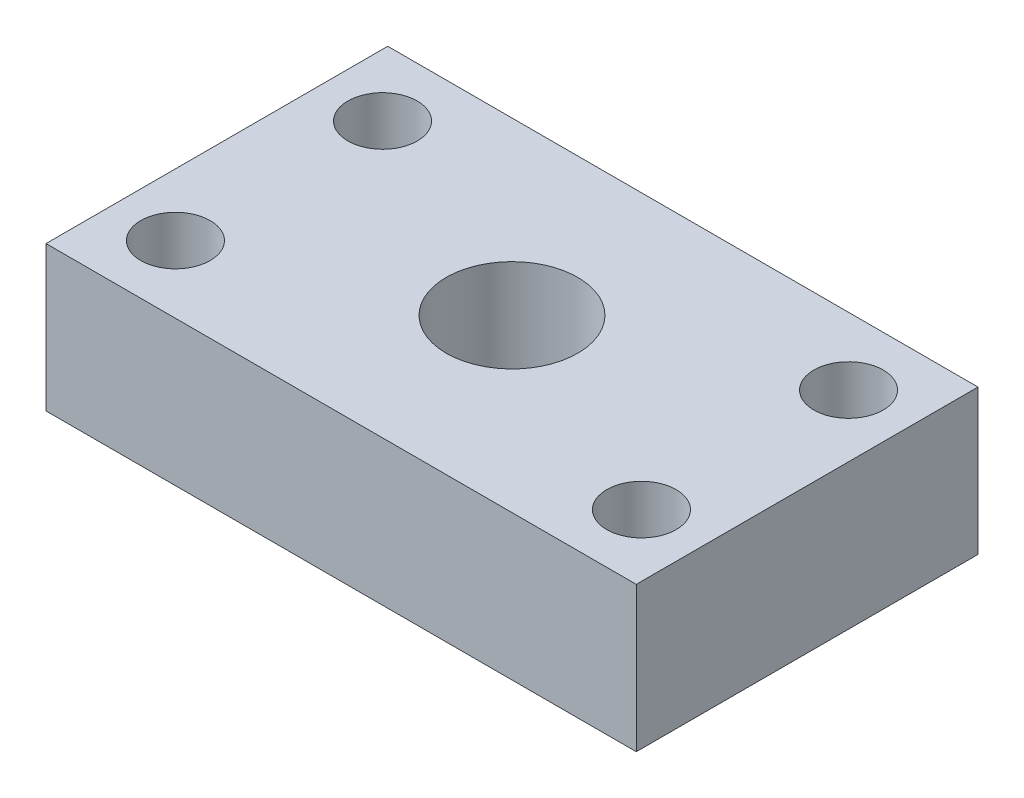
ISO-10303-21;
HEADER;
FILE_DESCRIPTION(('STEP AP214'),'2;1');
FILE_NAME('part.step','',(''),(''),'','','');
FILE_SCHEMA(('AUTOMOTIVE_DESIGN { 1 0 10303 214 1 1 1 1 }'));
ENDSEC;
DATA;
#1=APPLICATION_CONTEXT('core data for automotive mechanical design processes');
#2=APPLICATION_PROTOCOL_DEFINITION('international standard','automotive_design',2000,#1);
#3=PRODUCT_CONTEXT('',#1,'mechanical');
#4=PRODUCT('Part','Part','',(#3));
#5=PRODUCT_RELATED_PRODUCT_CATEGORY('part','',(#4));
#6=PRODUCT_DEFINITION_FORMATION('','',#4);
#7=PRODUCT_DEFINITION_CONTEXT('part definition',#1,'design');
#8=PRODUCT_DEFINITION('design','',#6,#7);
#9=PRODUCT_DEFINITION_SHAPE('','',#8);
#10=(LENGTH_UNIT() NAMED_UNIT(*) SI_UNIT(.MILLI.,.METRE.));
#11=(NAMED_UNIT(*) PLANE_ANGLE_UNIT() SI_UNIT($,.RADIAN.));
#12=(NAMED_UNIT(*) SI_UNIT($,.STERADIAN.) SOLID_ANGLE_UNIT());
#13=UNCERTAINTY_MEASURE_WITH_UNIT(LENGTH_MEASURE(1.E-05),#10,'distance_accuracy_value','');
#14=(GEOMETRIC_REPRESENTATION_CONTEXT(3) GLOBAL_UNCERTAINTY_ASSIGNED_CONTEXT((#13)) GLOBAL_UNIT_ASSIGNED_CONTEXT((#10,
#11,#12)) REPRESENTATION_CONTEXT('',''));
#15=CARTESIAN_POINT('',(0.,0.,0.));
#16=DIRECTION('',(0.,0.,1.));
#17=DIRECTION('',(1.,0.,0.));
#18=AXIS2_PLACEMENT_3D('',#15,#16,#17);
#19=CARTESIAN_POINT('',(0.,14.,0.));
#20=DIRECTION('',(1.,0.,0.));
#21=DIRECTION('',(0.,0.,-1.));
#22=AXIS2_PLACEMENT_3D('',#19,#20,#21);
#23=PLANE('',#22);
#24=DIRECTION('',(0.,0.,1.));
#25=VECTOR('',#24,1.);
#26=CARTESIAN_POINT('',(0.,0.,0.));
#27=LINE('',#26,#25);
#28=CARTESIAN_POINT('',(0.,0.,-33.));
#29=VERTEX_POINT('',#28);
#30=CARTESIAN_POINT('',(0.,0.,0.));
#31=VERTEX_POINT('',#30);
#32=EDGE_CURVE('E141',#29,#31,#27,.T.);
#33=ORIENTED_EDGE('',*,*,#32,.T.);
#34=DIRECTION('',(0.,-1.,0.));
#35=VECTOR('',#34,1.);
#36=CARTESIAN_POINT('',(0.,14.,0.));
#37=LINE('',#36,#35);
#38=CARTESIAN_POINT('',(0.,14.,0.));
#39=VERTEX_POINT('',#38);
#40=EDGE_CURVE('E11',#39,#31,#37,.T.);
#41=ORIENTED_EDGE('',*,*,#40,.F.);
#42=DIRECTION('',(0.,0.,1.));
#43=VECTOR('',#42,1.);
#44=CARTESIAN_POINT('',(0.,14.,0.));
#45=LINE('',#44,#43);
#46=CARTESIAN_POINT('',(0.,14.,-33.));
#47=VERTEX_POINT('',#46);
#48=EDGE_CURVE('E145',#47,#39,#45,.T.);
#49=ORIENTED_EDGE('',*,*,#48,.F.);
#50=DIRECTION('',(0.,-1.,0.));
#51=VECTOR('',#50,1.);
#52=CARTESIAN_POINT('',(0.,14.,-33.));
#53=LINE('',#52,#51);
#54=EDGE_CURVE('E155',#47,#29,#53,.T.);
#55=ORIENTED_EDGE('',*,*,#54,.T.);
#56=EDGE_LOOP('',(#33,#41,#49,#55));
#57=FACE_BOUND('',#56,.T.);
#58=ADVANCED_FACE('F41',(#57),#23,.F.);
#59=CARTESIAN_POINT('',(0.,14.,0.));
#60=DIRECTION('',(0.,0.,-1.));
#61=DIRECTION('',(-1.,0.,0.));
#62=AXIS2_PLACEMENT_3D('',#59,#60,#61);
#63=PLANE('',#62);
#64=DIRECTION('',(1.,0.,0.));
#65=VECTOR('',#64,1.);
#66=CARTESIAN_POINT('',(0.,0.,0.));
#67=LINE('',#66,#65);
#68=CARTESIAN_POINT('',(57.,0.,0.));
#69=VERTEX_POINT('',#68);
#70=EDGE_CURVE('E159',#31,#69,#67,.T.);
#71=ORIENTED_EDGE('',*,*,#70,.T.);
#72=DIRECTION('',(0.,-1.,0.));
#73=VECTOR('',#72,1.);
#74=CARTESIAN_POINT('',(57.,14.,0.));
#75=LINE('',#74,#73);
#76=CARTESIAN_POINT('',(57.,14.,0.));
#77=VERTEX_POINT('',#76);
#78=EDGE_CURVE('E50',#77,#69,#75,.T.);
#79=ORIENTED_EDGE('',*,*,#78,.F.);
#80=DIRECTION('',(1.,0.,0.));
#81=VECTOR('',#80,1.);
#82=CARTESIAN_POINT('',(0.,14.,0.));
#83=LINE('',#82,#81);
#84=EDGE_CURVE('E89',#39,#77,#83,.T.);
#85=ORIENTED_EDGE('',*,*,#84,.F.);
#86=ORIENTED_EDGE('',*,*,#40,.T.);
#87=EDGE_LOOP('',(#71,#79,#85,#86));
#88=FACE_BOUND('',#87,.T.);
#89=ADVANCED_FACE('F190',(#88),#63,.F.);
#90=CARTESIAN_POINT('',(57.,14.,0.));
#91=DIRECTION('',(-1.,0.,0.));
#92=DIRECTION('',(0.,0.,1.));
#93=AXIS2_PLACEMENT_3D('',#90,#91,#92);
#94=PLANE('',#93);
#95=DIRECTION('',(0.,0.,-1.));
#96=VECTOR('',#95,1.);
#97=CARTESIAN_POINT('',(57.,0.,0.));
#98=LINE('',#97,#96);
#99=CARTESIAN_POINT('',(57.,0.,-33.));
#100=VERTEX_POINT('',#99);
#101=EDGE_CURVE('E76',#69,#100,#98,.T.);
#102=ORIENTED_EDGE('',*,*,#101,.T.);
#103=DIRECTION('',(0.,-1.,0.));
#104=VECTOR('',#103,1.);
#105=CARTESIAN_POINT('',(57.,14.,-33.));
#106=LINE('',#105,#104);
#107=CARTESIAN_POINT('',(57.,14.,-33.));
#108=VERTEX_POINT('',#107);
#109=EDGE_CURVE('E168',#108,#100,#106,.T.);
#110=ORIENTED_EDGE('',*,*,#109,.F.);
#111=DIRECTION('',(0.,0.,-1.));
#112=VECTOR('',#111,1.);
#113=CARTESIAN_POINT('',(57.,14.,0.));
#114=LINE('',#113,#112);
#115=EDGE_CURVE('E150',#77,#108,#114,.T.);
#116=ORIENTED_EDGE('',*,*,#115,.F.);
#117=ORIENTED_EDGE('',*,*,#78,.T.);
#118=EDGE_LOOP('',(#102,#110,#116,#117));
#119=FACE_BOUND('',#118,.T.);
#120=ADVANCED_FACE('F172',(#119),#94,.F.);
#121=CARTESIAN_POINT('',(0.,14.,-33.));
#122=DIRECTION('',(0.,0.,1.));
#123=DIRECTION('',(1.,0.,0.));
#124=AXIS2_PLACEMENT_3D('',#121,#122,#123);
#125=PLANE('',#124);
#126=CARTESIAN_POINT('',(28.5,7.,-33.));
#127=DIRECTION('',(0.,0.,-1.));
#128=DIRECTION('',(-1.,0.,0.));
#129=AXIS2_PLACEMENT_3D('',#126,#127,#128);
#130=CIRCLE('',#129,1.72719999999999);
#131=CARTESIAN_POINT('',(26.7728,7.,-33.));
#132=VERTEX_POINT('',#131);
#133=EDGE_CURVE('E105',#132,#132,#130,.T.);
#134=ORIENTED_EDGE('',*,*,#133,.F.);
#135=EDGE_LOOP('',(#134));
#136=FACE_BOUND('',#135,.T.);
#137=DIRECTION('',(-1.,0.,0.));
#138=VECTOR('',#137,1.);
#139=CARTESIAN_POINT('',(0.,0.,-33.));
#140=LINE('',#139,#138);
#141=EDGE_CURVE('E82',#100,#29,#140,.T.);
#142=ORIENTED_EDGE('',*,*,#141,.T.);
#143=ORIENTED_EDGE('',*,*,#54,.F.);
#144=DIRECTION('',(-1.,0.,0.));
#145=VECTOR('',#144,1.);
#146=CARTESIAN_POINT('',(0.,14.,-33.));
#147=LINE('',#146,#145);
#148=EDGE_CURVE('E58',#108,#47,#147,.T.);
#149=ORIENTED_EDGE('',*,*,#148,.F.);
#150=ORIENTED_EDGE('',*,*,#109,.T.);
#151=EDGE_LOOP('',(#142,#143,#149,#150));
#152=FACE_BOUND('',#151,.T.);
#153=ADVANCED_FACE('F179',(#136,#152),#125,.F.);
#154=CARTESIAN_POINT('',(0.,14.,0.));
#155=DIRECTION('',(0.,-1.,0.));
#156=DIRECTION('',(0.,0.,-1.));
#157=AXIS2_PLACEMENT_3D('',#154,#155,#156);
#158=PLANE('',#157);
#159=CARTESIAN_POINT('',(28.5,14.,-16.5));
#160=DIRECTION('',(0.,1.,0.));
#161=DIRECTION('',(0.,0.,1.));
#162=AXIS2_PLACEMENT_3D('',#159,#160,#161);
#163=CIRCLE('',#162,6.34999999999999);
#164=CARTESIAN_POINT('',(28.5,14.,-10.15));
#165=VERTEX_POINT('',#164);
#166=EDGE_CURVE('E298',#165,#165,#163,.T.);
#167=ORIENTED_EDGE('',*,*,#166,.F.);
#168=EDGE_LOOP('',(#167));
#169=FACE_BOUND('',#168,.T.);
#170=CARTESIAN_POINT('',(51.,14.,-6.5));
#171=DIRECTION('',(0.,-1.,0.));
#172=DIRECTION('',(0.,0.,-1.));
#173=AXIS2_PLACEMENT_3D('',#170,#171,#172);
#174=CIRCLE('',#173,3.35000000000001);
#175=CARTESIAN_POINT('',(51.,14.,-9.85000000000001));
#176=VERTEX_POINT('',#175);
#177=EDGE_CURVE('E110',#176,#176,#174,.T.);
#178=ORIENTED_EDGE('',*,*,#177,.T.);
#179=EDGE_LOOP('',(#178));
#180=FACE_BOUND('',#179,.T.);
#181=CARTESIAN_POINT('',(6.00000000000001,14.,-26.5));
#182=DIRECTION('',(0.,-1.,0.));
#183=DIRECTION('',(0.,0.,-1.));
#184=AXIS2_PLACEMENT_3D('',#181,#182,#183);
#185=CIRCLE('',#184,3.35);
#186=CARTESIAN_POINT('',(6.00000000000001,14.,-29.85));
#187=VERTEX_POINT('',#186);
#188=EDGE_CURVE('E121',#187,#187,#185,.T.);
#189=ORIENTED_EDGE('',*,*,#188,.T.);
#190=EDGE_LOOP('',(#189));
#191=FACE_BOUND('',#190,.T.);
#192=CARTESIAN_POINT('',(51.,14.,-26.5));
#193=DIRECTION('',(0.,-1.,0.));
#194=DIRECTION('',(0.,0.,-1.));
#195=AXIS2_PLACEMENT_3D('',#192,#193,#194);
#196=CIRCLE('',#195,3.35000000000001);
#197=CARTESIAN_POINT('',(51.,14.,-29.85));
#198=VERTEX_POINT('',#197);
#199=EDGE_CURVE('E129',#198,#198,#196,.T.);
#200=ORIENTED_EDGE('',*,*,#199,.T.);
#201=EDGE_LOOP('',(#200));
#202=FACE_BOUND('',#201,.T.);
#203=CARTESIAN_POINT('',(6.,14.,-6.5));
#204=DIRECTION('',(0.,-1.,0.));
#205=DIRECTION('',(0.,0.,-1.));
#206=AXIS2_PLACEMENT_3D('',#203,#204,#205);
#207=CIRCLE('',#206,3.35);
#208=CARTESIAN_POINT('',(6.,14.,-9.85));
#209=VERTEX_POINT('',#208);
#210=EDGE_CURVE('E137',#209,#209,#207,.T.);
#211=ORIENTED_EDGE('',*,*,#210,.T.);
#212=EDGE_LOOP('',(#211));
#213=FACE_BOUND('',#212,.T.);
#214=ORIENTED_EDGE('',*,*,#48,.T.);
#215=ORIENTED_EDGE('',*,*,#84,.T.);
#216=ORIENTED_EDGE('',*,*,#115,.T.);
#217=ORIENTED_EDGE('',*,*,#148,.T.);
#218=EDGE_LOOP('',(#214,#215,#216,#217));
#219=FACE_BOUND('',#218,.T.);
#220=ADVANCED_FACE('F181',(#169,#180,#191,#202,#213,#219),#158,.F.);
#221=CARTESIAN_POINT('',(0.,0.,0.));
#222=DIRECTION('',(0.,-1.,0.));
#223=DIRECTION('',(0.,0.,-1.));
#224=AXIS2_PLACEMENT_3D('',#221,#222,#223);
#225=PLANE('',#224);
#226=CARTESIAN_POINT('',(28.5,0.,-16.5));
#227=DIRECTION('',(0.,1.,0.));
#228=DIRECTION('',(0.,0.,1.));
#229=AXIS2_PLACEMENT_3D('',#226,#227,#228);
#230=CIRCLE('',#229,6.34999999999999);
#231=CARTESIAN_POINT('',(28.5,0.,-10.15));
#232=VERTEX_POINT('',#231);
#233=EDGE_CURVE('E113',#232,#232,#230,.T.);
#234=ORIENTED_EDGE('',*,*,#233,.T.);
#235=EDGE_LOOP('',(#234));
#236=FACE_BOUND('',#235,.T.);
#237=CARTESIAN_POINT('',(51.,0.,-6.5));
#238=DIRECTION('',(0.,-1.,0.));
#239=DIRECTION('',(0.,0.,-1.));
#240=AXIS2_PLACEMENT_3D('',#237,#238,#239);
#241=CIRCLE('',#240,3.35000000000001);
#242=CARTESIAN_POINT('',(51.,0.,-9.85000000000001));
#243=VERTEX_POINT('',#242);
#244=EDGE_CURVE('E104',#243,#243,#241,.T.);
#245=ORIENTED_EDGE('',*,*,#244,.F.);
#246=EDGE_LOOP('',(#245));
#247=FACE_BOUND('',#246,.T.);
#248=CARTESIAN_POINT('',(6.00000000000001,0.,-26.5));
#249=DIRECTION('',(0.,-1.,0.));
#250=DIRECTION('',(0.,0.,-1.));
#251=AXIS2_PLACEMENT_3D('',#248,#249,#250);
#252=CIRCLE('',#251,3.35);
#253=CARTESIAN_POINT('',(6.00000000000001,0.,-29.85));
#254=VERTEX_POINT('',#253);
#255=EDGE_CURVE('E119',#254,#254,#252,.T.);
#256=ORIENTED_EDGE('',*,*,#255,.F.);
#257=EDGE_LOOP('',(#256));
#258=FACE_BOUND('',#257,.T.);
#259=CARTESIAN_POINT('',(51.,0.,-26.5));
#260=DIRECTION('',(0.,-1.,0.));
#261=DIRECTION('',(0.,0.,-1.));
#262=AXIS2_PLACEMENT_3D('',#259,#260,#261);
#263=CIRCLE('',#262,3.35000000000001);
#264=CARTESIAN_POINT('',(51.,0.,-29.85));
#265=VERTEX_POINT('',#264);
#266=EDGE_CURVE('E125',#265,#265,#263,.T.);
#267=ORIENTED_EDGE('',*,*,#266,.F.);
#268=EDGE_LOOP('',(#267));
#269=FACE_BOUND('',#268,.T.);
#270=CARTESIAN_POINT('',(6.,0.,-6.5));
#271=DIRECTION('',(0.,-1.,0.));
#272=DIRECTION('',(0.,0.,-1.));
#273=AXIS2_PLACEMENT_3D('',#270,#271,#272);
#274=CIRCLE('',#273,3.35);
#275=CARTESIAN_POINT('',(6.,0.,-9.85));
#276=VERTEX_POINT('',#275);
#277=EDGE_CURVE('E133',#276,#276,#274,.T.);
#278=ORIENTED_EDGE('',*,*,#277,.F.);
#279=EDGE_LOOP('',(#278));
#280=FACE_BOUND('',#279,.T.);
#281=ORIENTED_EDGE('',*,*,#32,.F.);
#282=ORIENTED_EDGE('',*,*,#141,.F.);
#283=ORIENTED_EDGE('',*,*,#101,.F.);
#284=ORIENTED_EDGE('',*,*,#70,.F.);
#285=EDGE_LOOP('',(#281,#282,#283,#284));
#286=FACE_BOUND('',#285,.T.);
#287=ADVANCED_FACE('F175',(#236,#247,#258,#269,#280,#286),#225,.T.);
#288=CARTESIAN_POINT('',(6.,14.,-6.5));
#289=DIRECTION('',(0.,-1.,0.));
#290=DIRECTION('',(0.,0.,-1.));
#291=AXIS2_PLACEMENT_3D('',#288,#289,#290);
#292=CYLINDRICAL_SURFACE('',#291,3.35);
#293=ORIENTED_EDGE('',*,*,#210,.F.);
#294=EDGE_LOOP('',(#293));
#295=FACE_BOUND('',#294,.T.);
#296=ORIENTED_EDGE('',*,*,#277,.T.);
#297=EDGE_LOOP('',(#296));
#298=FACE_BOUND('',#297,.T.);
#299=ADVANCED_FACE('F210',(#295,#298),#292,.F.);
#300=CARTESIAN_POINT('',(51.,14.,-26.5));
#301=DIRECTION('',(0.,-1.,0.));
#302=DIRECTION('',(0.,0.,-1.));
#303=AXIS2_PLACEMENT_3D('',#300,#301,#302);
#304=CYLINDRICAL_SURFACE('',#303,3.35000000000001);
#305=ORIENTED_EDGE('',*,*,#199,.F.);
#306=EDGE_LOOP('',(#305));
#307=FACE_BOUND('',#306,.T.);
#308=ORIENTED_EDGE('',*,*,#266,.T.);
#309=EDGE_LOOP('',(#308));
#310=FACE_BOUND('',#309,.T.);
#311=ADVANCED_FACE('F215',(#307,#310),#304,.F.);
#312=CARTESIAN_POINT('',(6.00000000000001,14.,-26.5));
#313=DIRECTION('',(0.,-1.,0.));
#314=DIRECTION('',(0.,0.,-1.));
#315=AXIS2_PLACEMENT_3D('',#312,#313,#314);
#316=CYLINDRICAL_SURFACE('',#315,3.35);
#317=ORIENTED_EDGE('',*,*,#188,.F.);
#318=EDGE_LOOP('',(#317));
#319=FACE_BOUND('',#318,.T.);
#320=ORIENTED_EDGE('',*,*,#255,.T.);
#321=EDGE_LOOP('',(#320));
#322=FACE_BOUND('',#321,.T.);
#323=ADVANCED_FACE('F227',(#319,#322),#316,.F.);
#324=CARTESIAN_POINT('',(51.,14.,-6.5));
#325=DIRECTION('',(0.,-1.,0.));
#326=DIRECTION('',(0.,0.,-1.));
#327=AXIS2_PLACEMENT_3D('',#324,#325,#326);
#328=CYLINDRICAL_SURFACE('',#327,3.35000000000001);
#329=ORIENTED_EDGE('',*,*,#177,.F.);
#330=EDGE_LOOP('',(#329));
#331=FACE_BOUND('',#330,.T.);
#332=ORIENTED_EDGE('',*,*,#244,.T.);
#333=EDGE_LOOP('',(#332));
#334=FACE_BOUND('',#333,.T.);
#335=ADVANCED_FACE('F97',(#331,#334),#328,.F.);
#336=CARTESIAN_POINT('',(28.5,7.,-28.));
#337=DIRECTION('',(0.,0.,-1.));
#338=DIRECTION('',(-1.,0.,0.));
#339=AXIS2_PLACEMENT_3D('',#336,#337,#338);
#340=CONICAL_SURFACE('',#339,1.7272,1.02974425867665);
#341=CARTESIAN_POINT('',(28.5,7.,-26.9621935388156));
#342=VERTEX_POINT('',#341);
#343=VERTEX_LOOP('',#342);
#344=FACE_BOUND('',#343,.T.);
#345=CARTESIAN_POINT('',(28.5,7.,-28.));
#346=DIRECTION('',(0.,0.,-1.));
#347=DIRECTION('',(-1.,0.,0.));
#348=AXIS2_PLACEMENT_3D('',#345,#346,#347);
#349=CIRCLE('',#348,1.7272);
#350=CARTESIAN_POINT('',(26.7728,7.,-28.));
#351=VERTEX_POINT('',#350);
#352=EDGE_CURVE('E101',#351,#351,#349,.T.);
#353=ORIENTED_EDGE('',*,*,#352,.T.);
#354=EDGE_LOOP('',(#353));
#355=FACE_BOUND('',#354,.T.);
#356=ADVANCED_FACE('F93',(#344,#355),#340,.F.);
#357=CARTESIAN_POINT('',(28.5,7.,-33.));
#358=DIRECTION('',(0.,0.,-1.));
#359=DIRECTION('',(-1.,0.,0.));
#360=AXIS2_PLACEMENT_3D('',#357,#358,#359);
#361=CYLINDRICAL_SURFACE('',#360,1.72719999999999);
#362=ORIENTED_EDGE('',*,*,#352,.F.);
#363=EDGE_LOOP('',(#362));
#364=FACE_BOUND('',#363,.T.);
#365=ORIENTED_EDGE('',*,*,#133,.T.);
#366=EDGE_LOOP('',(#365));
#367=FACE_BOUND('',#366,.T.);
#368=ADVANCED_FACE('F96',(#364,#367),#361,.F.);
#369=CARTESIAN_POINT('',(28.5,14.,-16.5));
#370=DIRECTION('',(0.,1.,0.));
#371=DIRECTION('',(0.,0.,1.));
#372=AXIS2_PLACEMENT_3D('',#369,#370,#371);
#373=CYLINDRICAL_SURFACE('',#372,6.34999999999999);
#374=ORIENTED_EDGE('',*,*,#233,.F.);
#375=EDGE_LOOP('',(#374));
#376=FACE_BOUND('',#375,.T.);
#377=ORIENTED_EDGE('',*,*,#166,.T.);
#378=EDGE_LOOP('',(#377));
#379=FACE_BOUND('',#378,.T.);
#380=ADVANCED_FACE('F266',(#376,#379),#373,.F.);
#381=CLOSED_SHELL('',(#58,#89,#120,#153,#220,#287,#299,#311,#323,#335,#356,#368,#380));
#382=MANIFOLD_SOLID_BREP('B2',#381);
#383=ADVANCED_BREP_SHAPE_REPRESENTATION('',(#18,#382),#14);
#384=SHAPE_DEFINITION_REPRESENTATION(#9,#383);
ENDSEC;
END-ISO-10303-21;
